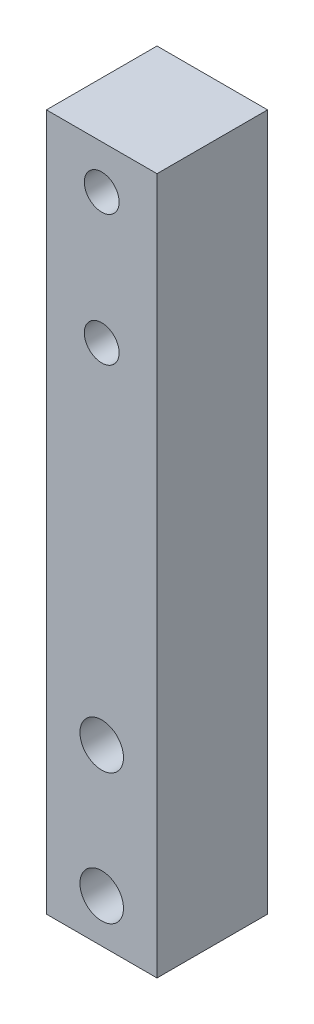
ISO-10303-21;
HEADER;
FILE_DESCRIPTION(('STEP AP214'),'2;1');
FILE_NAME('part.step','',(''),(''),'','','');
FILE_SCHEMA(('AUTOMOTIVE_DESIGN { 1 0 10303 214 1 1 1 1 }'));
ENDSEC;
DATA;
#1=APPLICATION_CONTEXT('core data for automotive mechanical design processes');
#2=APPLICATION_PROTOCOL_DEFINITION('international standard','automotive_design',2000,#1);
#3=PRODUCT_CONTEXT('',#1,'mechanical');
#4=PRODUCT('Part','Part','',(#3));
#5=PRODUCT_RELATED_PRODUCT_CATEGORY('part','',(#4));
#6=PRODUCT_DEFINITION_FORMATION('','',#4);
#7=PRODUCT_DEFINITION_CONTEXT('part definition',#1,'design');
#8=PRODUCT_DEFINITION('design','',#6,#7);
#9=PRODUCT_DEFINITION_SHAPE('','',#8);
#10=(LENGTH_UNIT() NAMED_UNIT(*) SI_UNIT(.MILLI.,.METRE.));
#11=(NAMED_UNIT(*) PLANE_ANGLE_UNIT() SI_UNIT($,.RADIAN.));
#12=(NAMED_UNIT(*) SI_UNIT($,.STERADIAN.) SOLID_ANGLE_UNIT());
#13=UNCERTAINTY_MEASURE_WITH_UNIT(LENGTH_MEASURE(1.E-05),#10,'distance_accuracy_value','');
#14=(GEOMETRIC_REPRESENTATION_CONTEXT(3) GLOBAL_UNCERTAINTY_ASSIGNED_CONTEXT((#13)) GLOBAL_UNIT_ASSIGNED_CONTEXT((#10,
#11,#12)) REPRESENTATION_CONTEXT('',''));
#15=CARTESIAN_POINT('',(0.,0.,0.));
#16=DIRECTION('',(0.,0.,1.));
#17=DIRECTION('',(1.,0.,0.));
#18=AXIS2_PLACEMENT_3D('',#15,#16,#17);
#19=CARTESIAN_POINT('',(12.7,80.,12.7));
#20=DIRECTION('',(0.,-1.,0.));
#21=DIRECTION('',(0.,0.,-1.));
#22=AXIS2_PLACEMENT_3D('',#19,#20,#21);
#23=PLANE('',#22);
#24=DIRECTION('',(-1.,0.,0.));
#25=VECTOR('',#24,1.);
#26=CARTESIAN_POINT('',(12.7,80.,0.));
#27=LINE('',#26,#25);
#28=CARTESIAN_POINT('',(12.7,80.,0.));
#29=VERTEX_POINT('',#28);
#30=CARTESIAN_POINT('',(0.,80.,0.));
#31=VERTEX_POINT('',#30);
#32=EDGE_CURVE('E109',#29,#31,#27,.T.);
#33=ORIENTED_EDGE('',*,*,#32,.T.);
#34=DIRECTION('',(0.,0.,-1.));
#35=VECTOR('',#34,1.);
#36=CARTESIAN_POINT('',(0.,80.,12.7));
#37=LINE('',#36,#35);
#38=CARTESIAN_POINT('',(0.,80.,12.7));
#39=VERTEX_POINT('',#38);
#40=EDGE_CURVE('E11',#39,#31,#37,.T.);
#41=ORIENTED_EDGE('',*,*,#40,.F.);
#42=DIRECTION('',(-1.,0.,0.));
#43=VECTOR('',#42,1.);
#44=CARTESIAN_POINT('',(12.7,80.,12.7));
#45=LINE('',#44,#43);
#46=CARTESIAN_POINT('',(12.7,80.,12.7));
#47=VERTEX_POINT('',#46);
#48=EDGE_CURVE('E94',#47,#39,#45,.T.);
#49=ORIENTED_EDGE('',*,*,#48,.F.);
#50=DIRECTION('',(0.,0.,-1.));
#51=VECTOR('',#50,1.);
#52=CARTESIAN_POINT('',(12.7,80.,12.7));
#53=LINE('',#52,#51);
#54=EDGE_CURVE('E105',#47,#29,#53,.T.);
#55=ORIENTED_EDGE('',*,*,#54,.T.);
#56=EDGE_LOOP('',(#33,#41,#49,#55));
#57=FACE_BOUND('',#56,.T.);
#58=ADVANCED_FACE('F42',(#57),#23,.F.);
#59=CARTESIAN_POINT('',(0.,80.,12.7));
#60=DIRECTION('',(1.,0.,0.));
#61=DIRECTION('',(0.,1.,0.));
#62=AXIS2_PLACEMENT_3D('',#59,#60,#61);
#63=PLANE('',#62);
#64=DIRECTION('',(0.,-1.,0.));
#65=VECTOR('',#64,1.);
#66=CARTESIAN_POINT('',(0.,80.,0.));
#67=LINE('',#66,#65);
#68=CARTESIAN_POINT('',(0.,0.,0.));
#69=VERTEX_POINT('',#68);
#70=EDGE_CURVE('E99',#31,#69,#67,.T.);
#71=ORIENTED_EDGE('',*,*,#70,.T.);
#72=DIRECTION('',(0.,0.,-1.));
#73=VECTOR('',#72,1.);
#74=CARTESIAN_POINT('',(0.,0.,12.7));
#75=LINE('',#74,#73);
#76=CARTESIAN_POINT('',(0.,0.,12.7));
#77=VERTEX_POINT('',#76);
#78=EDGE_CURVE('E50',#77,#69,#75,.T.);
#79=ORIENTED_EDGE('',*,*,#78,.F.);
#80=DIRECTION('',(0.,-1.,0.));
#81=VECTOR('',#80,1.);
#82=CARTESIAN_POINT('',(0.,80.,12.7));
#83=LINE('',#82,#81);
#84=EDGE_CURVE('E89',#39,#77,#83,.T.);
#85=ORIENTED_EDGE('',*,*,#84,.F.);
#86=ORIENTED_EDGE('',*,*,#40,.T.);
#87=EDGE_LOOP('',(#71,#79,#85,#86));
#88=FACE_BOUND('',#87,.T.);
#89=ADVANCED_FACE('F98',(#88),#63,.F.);
#90=CARTESIAN_POINT('',(0.,0.,12.7));
#91=DIRECTION('',(0.,1.,0.));
#92=DIRECTION('',(0.,0.,1.));
#93=AXIS2_PLACEMENT_3D('',#90,#91,#92);
#94=PLANE('',#93);
#95=DIRECTION('',(1.,0.,0.));
#96=VECTOR('',#95,1.);
#97=CARTESIAN_POINT('',(0.,0.,0.));
#98=LINE('',#97,#96);
#99=CARTESIAN_POINT('',(12.7,0.,0.));
#100=VERTEX_POINT('',#99);
#101=EDGE_CURVE('E76',#69,#100,#98,.T.);
#102=ORIENTED_EDGE('',*,*,#101,.T.);
#103=DIRECTION('',(0.,0.,-1.));
#104=VECTOR('',#103,1.);
#105=CARTESIAN_POINT('',(12.7,0.,12.7));
#106=LINE('',#105,#104);
#107=CARTESIAN_POINT('',(12.7,0.,12.7));
#108=VERTEX_POINT('',#107);
#109=EDGE_CURVE('E101',#108,#100,#106,.T.);
#110=ORIENTED_EDGE('',*,*,#109,.F.);
#111=DIRECTION('',(1.,0.,0.));
#112=VECTOR('',#111,1.);
#113=CARTESIAN_POINT('',(0.,0.,12.7));
#114=LINE('',#113,#112);
#115=EDGE_CURVE('E92',#77,#108,#114,.T.);
#116=ORIENTED_EDGE('',*,*,#115,.F.);
#117=ORIENTED_EDGE('',*,*,#78,.T.);
#118=EDGE_LOOP('',(#102,#110,#116,#117));
#119=FACE_BOUND('',#118,.T.);
#120=ADVANCED_FACE('F102',(#119),#94,.F.);
#121=CARTESIAN_POINT('',(12.7,0.,12.7));
#122=DIRECTION('',(-1.,0.,0.));
#123=DIRECTION('',(0.,-1.,0.));
#124=AXIS2_PLACEMENT_3D('',#121,#122,#123);
#125=PLANE('',#124);
#126=DIRECTION('',(0.,1.,0.));
#127=VECTOR('',#126,1.);
#128=CARTESIAN_POINT('',(12.7,0.,0.));
#129=LINE('',#128,#127);
#130=EDGE_CURVE('E82',#100,#29,#129,.T.);
#131=ORIENTED_EDGE('',*,*,#130,.T.);
#132=ORIENTED_EDGE('',*,*,#54,.F.);
#133=DIRECTION('',(0.,1.,0.));
#134=VECTOR('',#133,1.);
#135=CARTESIAN_POINT('',(12.7,0.,12.7));
#136=LINE('',#135,#134);
#137=EDGE_CURVE('E58',#108,#47,#136,.T.);
#138=ORIENTED_EDGE('',*,*,#137,.F.);
#139=ORIENTED_EDGE('',*,*,#109,.T.);
#140=EDGE_LOOP('',(#131,#132,#138,#139));
#141=FACE_BOUND('',#140,.T.);
#142=ADVANCED_FACE('F120',(#141),#125,.F.);
#143=CARTESIAN_POINT('',(0.,0.,12.7));
#144=DIRECTION('',(0.,0.,1.));
#145=DIRECTION('',(1.,0.,0.));
#146=AXIS2_PLACEMENT_3D('',#143,#144,#145);
#147=PLANE('',#146);
#148=CARTESIAN_POINT('',(6.35,5.,12.7));
#149=DIRECTION('',(0.,0.,1.));
#150=DIRECTION('',(1.,0.,0.));
#151=AXIS2_PLACEMENT_3D('',#148,#149,#150);
#152=CIRCLE('',#151,2.5);
#153=CARTESIAN_POINT('',(8.85,5.,12.7));
#154=VERTEX_POINT('',#153);
#155=EDGE_CURVE('E112',#154,#154,#152,.T.);
#156=ORIENTED_EDGE('',*,*,#155,.F.);
#157=EDGE_LOOP('',(#156));
#158=FACE_BOUND('',#157,.T.);
#159=CARTESIAN_POINT('',(6.35,20.,12.7));
#160=DIRECTION('',(0.,0.,1.));
#161=DIRECTION('',(1.,0.,0.));
#162=AXIS2_PLACEMENT_3D('',#159,#160,#161);
#163=CIRCLE('',#162,2.5);
#164=CARTESIAN_POINT('',(8.85,20.,12.7));
#165=VERTEX_POINT('',#164);
#166=EDGE_CURVE('E143',#165,#165,#163,.T.);
#167=ORIENTED_EDGE('',*,*,#166,.F.);
#168=EDGE_LOOP('',(#167));
#169=FACE_BOUND('',#168,.T.);
#170=CARTESIAN_POINT('',(6.35,60.,12.7));
#171=DIRECTION('',(0.,0.,1.));
#172=DIRECTION('',(1.,0.,0.));
#173=AXIS2_PLACEMENT_3D('',#170,#171,#172);
#174=CIRCLE('',#173,2.);
#175=CARTESIAN_POINT('',(8.35,60.,12.7));
#176=VERTEX_POINT('',#175);
#177=EDGE_CURVE('E136',#176,#176,#174,.T.);
#178=ORIENTED_EDGE('',*,*,#177,.F.);
#179=EDGE_LOOP('',(#178));
#180=FACE_BOUND('',#179,.T.);
#181=CARTESIAN_POINT('',(6.35,75.,12.7));
#182=DIRECTION('',(0.,0.,1.));
#183=DIRECTION('',(1.,0.,0.));
#184=AXIS2_PLACEMENT_3D('',#181,#182,#183);
#185=CIRCLE('',#184,2.);
#186=CARTESIAN_POINT('',(8.35,75.,12.7));
#187=VERTEX_POINT('',#186);
#188=EDGE_CURVE('E129',#187,#187,#185,.T.);
#189=ORIENTED_EDGE('',*,*,#188,.F.);
#190=EDGE_LOOP('',(#189));
#191=FACE_BOUND('',#190,.T.);
#192=ORIENTED_EDGE('',*,*,#48,.T.);
#193=ORIENTED_EDGE('',*,*,#84,.T.);
#194=ORIENTED_EDGE('',*,*,#115,.T.);
#195=ORIENTED_EDGE('',*,*,#137,.T.);
#196=EDGE_LOOP('',(#192,#193,#194,#195));
#197=FACE_BOUND('',#196,.T.);
#198=ADVANCED_FACE('F90',(#158,#169,#180,#191,#197),#147,.T.);
#199=CARTESIAN_POINT('',(0.,0.,0.));
#200=DIRECTION('',(0.,0.,1.));
#201=DIRECTION('',(1.,0.,0.));
#202=AXIS2_PLACEMENT_3D('',#199,#200,#201);
#203=PLANE('',#202);
#204=CARTESIAN_POINT('',(6.35,5.,0.));
#205=DIRECTION('',(0.,0.,1.));
#206=DIRECTION('',(1.,0.,0.));
#207=AXIS2_PLACEMENT_3D('',#204,#205,#206);
#208=CIRCLE('',#207,2.5);
#209=CARTESIAN_POINT('',(8.85,5.,0.));
#210=VERTEX_POINT('',#209);
#211=EDGE_CURVE('E146',#210,#210,#208,.T.);
#212=ORIENTED_EDGE('',*,*,#211,.T.);
#213=EDGE_LOOP('',(#212));
#214=FACE_BOUND('',#213,.T.);
#215=CARTESIAN_POINT('',(6.35,20.,0.));
#216=DIRECTION('',(0.,0.,1.));
#217=DIRECTION('',(1.,0.,0.));
#218=AXIS2_PLACEMENT_3D('',#215,#216,#217);
#219=CIRCLE('',#218,2.5);
#220=CARTESIAN_POINT('',(8.85,20.,0.));
#221=VERTEX_POINT('',#220);
#222=EDGE_CURVE('E139',#221,#221,#219,.T.);
#223=ORIENTED_EDGE('',*,*,#222,.T.);
#224=EDGE_LOOP('',(#223));
#225=FACE_BOUND('',#224,.T.);
#226=CARTESIAN_POINT('',(6.35,60.,0.));
#227=DIRECTION('',(0.,0.,1.));
#228=DIRECTION('',(1.,0.,0.));
#229=AXIS2_PLACEMENT_3D('',#226,#227,#228);
#230=CIRCLE('',#229,2.);
#231=CARTESIAN_POINT('',(8.35,60.,0.));
#232=VERTEX_POINT('',#231);
#233=EDGE_CURVE('E132',#232,#232,#230,.T.);
#234=ORIENTED_EDGE('',*,*,#233,.T.);
#235=EDGE_LOOP('',(#234));
#236=FACE_BOUND('',#235,.T.);
#237=CARTESIAN_POINT('',(6.35,75.,0.));
#238=DIRECTION('',(0.,0.,1.));
#239=DIRECTION('',(1.,0.,0.));
#240=AXIS2_PLACEMENT_3D('',#237,#238,#239);
#241=CIRCLE('',#240,2.);
#242=CARTESIAN_POINT('',(8.35,75.,0.));
#243=VERTEX_POINT('',#242);
#244=EDGE_CURVE('E126',#243,#243,#241,.T.);
#245=ORIENTED_EDGE('',*,*,#244,.T.);
#246=EDGE_LOOP('',(#245));
#247=FACE_BOUND('',#246,.T.);
#248=ORIENTED_EDGE('',*,*,#32,.F.);
#249=ORIENTED_EDGE('',*,*,#130,.F.);
#250=ORIENTED_EDGE('',*,*,#101,.F.);
#251=ORIENTED_EDGE('',*,*,#70,.F.);
#252=EDGE_LOOP('',(#248,#249,#250,#251));
#253=FACE_BOUND('',#252,.T.);
#254=ADVANCED_FACE('F123',(#214,#225,#236,#247,#253),#203,.F.);
#255=CARTESIAN_POINT('',(6.35,75.,12.7));
#256=DIRECTION('',(0.,0.,-1.));
#257=DIRECTION('',(-1.,0.,0.));
#258=AXIS2_PLACEMENT_3D('',#255,#256,#257);
#259=CYLINDRICAL_SURFACE('',#258,2.);
#260=ORIENTED_EDGE('',*,*,#188,.T.);
#261=EDGE_LOOP('',(#260));
#262=FACE_BOUND('',#261,.T.);
#263=ORIENTED_EDGE('',*,*,#244,.F.);
#264=EDGE_LOOP('',(#263));
#265=FACE_BOUND('',#264,.T.);
#266=ADVANCED_FACE('F164',(#262,#265),#259,.F.);
#267=CARTESIAN_POINT('',(6.35,60.,12.7));
#268=DIRECTION('',(0.,0.,-1.));
#269=DIRECTION('',(-1.,0.,0.));
#270=AXIS2_PLACEMENT_3D('',#267,#268,#269);
#271=CYLINDRICAL_SURFACE('',#270,2.);
#272=ORIENTED_EDGE('',*,*,#177,.T.);
#273=EDGE_LOOP('',(#272));
#274=FACE_BOUND('',#273,.T.);
#275=ORIENTED_EDGE('',*,*,#233,.F.);
#276=EDGE_LOOP('',(#275));
#277=FACE_BOUND('',#276,.T.);
#278=ADVANCED_FACE('F167',(#274,#277),#271,.F.);
#279=CARTESIAN_POINT('',(6.35,20.,12.7));
#280=DIRECTION('',(0.,0.,-1.));
#281=DIRECTION('',(-1.,0.,0.));
#282=AXIS2_PLACEMENT_3D('',#279,#280,#281);
#283=CYLINDRICAL_SURFACE('',#282,2.5);
#284=ORIENTED_EDGE('',*,*,#166,.T.);
#285=EDGE_LOOP('',(#284));
#286=FACE_BOUND('',#285,.T.);
#287=ORIENTED_EDGE('',*,*,#222,.F.);
#288=EDGE_LOOP('',(#287));
#289=FACE_BOUND('',#288,.T.);
#290=ADVANCED_FACE('F214',(#286,#289),#283,.F.);
#291=CARTESIAN_POINT('',(6.35,5.,12.7));
#292=DIRECTION('',(0.,0.,-1.));
#293=DIRECTION('',(-1.,0.,0.));
#294=AXIS2_PLACEMENT_3D('',#291,#292,#293);
#295=CYLINDRICAL_SURFACE('',#294,2.5);
#296=ORIENTED_EDGE('',*,*,#155,.T.);
#297=EDGE_LOOP('',(#296));
#298=FACE_BOUND('',#297,.T.);
#299=ORIENTED_EDGE('',*,*,#211,.F.);
#300=EDGE_LOOP('',(#299));
#301=FACE_BOUND('',#300,.T.);
#302=ADVANCED_FACE('F152',(#298,#301),#295,.F.);
#303=CLOSED_SHELL('',(#58,#89,#120,#142,#198,#254,#266,#278,#290,#302));
#304=MANIFOLD_SOLID_BREP('B2',#303);
#305=ADVANCED_BREP_SHAPE_REPRESENTATION('',(#18,#304),#14);
#306=SHAPE_DEFINITION_REPRESENTATION(#9,#305);
ENDSEC;
END-ISO-10303-21;
